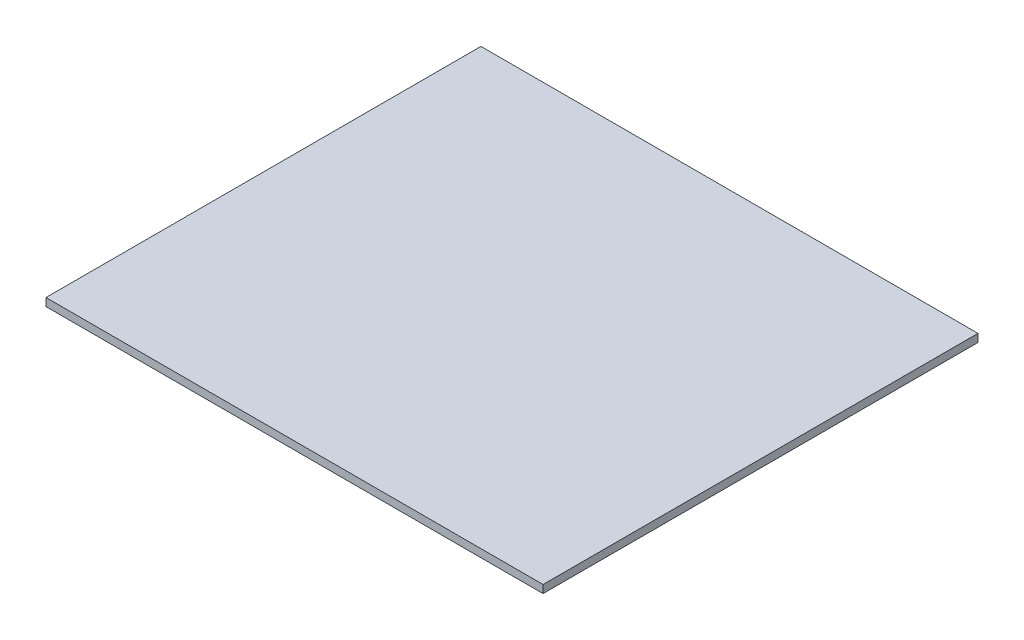
ISO-10303-21;
HEADER;
FILE_DESCRIPTION(('STEP AP214'),'2;1');
FILE_NAME('part.step','',(''),(''),'','','');
FILE_SCHEMA(('AUTOMOTIVE_DESIGN { 1 0 10303 214 1 1 1 1 }'));
ENDSEC;
DATA;
#1=APPLICATION_CONTEXT('core data for automotive mechanical design processes');
#2=APPLICATION_PROTOCOL_DEFINITION('international standard','automotive_design',2000,#1);
#3=PRODUCT_CONTEXT('',#1,'mechanical');
#4=PRODUCT('Part','Part','',(#3));
#5=PRODUCT_RELATED_PRODUCT_CATEGORY('part','',(#4));
#6=PRODUCT_DEFINITION_FORMATION('','',#4);
#7=PRODUCT_DEFINITION_CONTEXT('part definition',#1,'design');
#8=PRODUCT_DEFINITION('design','',#6,#7);
#9=PRODUCT_DEFINITION_SHAPE('','',#8);
#10=(LENGTH_UNIT() NAMED_UNIT(*) SI_UNIT(.MILLI.,.METRE.));
#11=(NAMED_UNIT(*) PLANE_ANGLE_UNIT() SI_UNIT($,.RADIAN.));
#12=(NAMED_UNIT(*) SI_UNIT($,.STERADIAN.) SOLID_ANGLE_UNIT());
#13=UNCERTAINTY_MEASURE_WITH_UNIT(LENGTH_MEASURE(1.E-05),#10,'distance_accuracy_value','');
#14=(GEOMETRIC_REPRESENTATION_CONTEXT(3) GLOBAL_UNCERTAINTY_ASSIGNED_CONTEXT((#13)) GLOBAL_UNIT_ASSIGNED_CONTEXT((#10,
#11,#12)) REPRESENTATION_CONTEXT('',''));
#15=CARTESIAN_POINT('',(0.,0.,0.));
#16=DIRECTION('',(0.,0.,1.));
#17=DIRECTION('',(1.,0.,0.));
#18=AXIS2_PLACEMENT_3D('',#15,#16,#17);
#19=CARTESIAN_POINT('',(0.,6.35,0.));
#20=DIRECTION('',(1.,0.,0.));
#21=DIRECTION('',(0.,0.,-1.));
#22=AXIS2_PLACEMENT_3D('',#19,#20,#21);
#23=PLANE('',#22);
#24=DIRECTION('',(0.,0.,1.));
#25=VECTOR('',#24,1.);
#26=CARTESIAN_POINT('',(0.,0.,0.));
#27=LINE('',#26,#25);
#28=CARTESIAN_POINT('',(0.,0.,-350.));
#29=VERTEX_POINT('',#28);
#30=CARTESIAN_POINT('',(0.,0.,0.));
#31=VERTEX_POINT('',#30);
#32=EDGE_CURVE('E108',#29,#31,#27,.T.);
#33=ORIENTED_EDGE('',*,*,#32,.T.);
#34=DIRECTION('',(0.,-1.,0.));
#35=VECTOR('',#34,1.);
#36=CARTESIAN_POINT('',(0.,6.35,0.));
#37=LINE('',#36,#35);
#38=CARTESIAN_POINT('',(0.,6.35,0.));
#39=VERTEX_POINT('',#38);
#40=EDGE_CURVE('E11',#39,#31,#37,.T.);
#41=ORIENTED_EDGE('',*,*,#40,.F.);
#42=DIRECTION('',(0.,0.,1.));
#43=VECTOR('',#42,1.);
#44=CARTESIAN_POINT('',(0.,6.35,0.));
#45=LINE('',#44,#43);
#46=CARTESIAN_POINT('',(0.,6.35,-350.));
#47=VERTEX_POINT('',#46);
#48=EDGE_CURVE('E96',#47,#39,#45,.T.);
#49=ORIENTED_EDGE('',*,*,#48,.F.);
#50=DIRECTION('',(0.,-1.,0.));
#51=VECTOR('',#50,1.);
#52=CARTESIAN_POINT('',(0.,6.35,-350.));
#53=LINE('',#52,#51);
#54=EDGE_CURVE('E104',#47,#29,#53,.T.);
#55=ORIENTED_EDGE('',*,*,#54,.T.);
#56=EDGE_LOOP('',(#33,#41,#49,#55));
#57=FACE_BOUND('',#56,.T.);
#58=ADVANCED_FACE('F45',(#57),#23,.F.);
#59=CARTESIAN_POINT('',(0.,6.35,0.));
#60=DIRECTION('',(0.,0.,-1.));
#61=DIRECTION('',(-1.,0.,0.));
#62=AXIS2_PLACEMENT_3D('',#59,#60,#61);
#63=PLANE('',#62);
#64=DIRECTION('',(1.,0.,0.));
#65=VECTOR('',#64,1.);
#66=CARTESIAN_POINT('',(0.,0.,0.));
#67=LINE('',#66,#65);
#68=CARTESIAN_POINT('',(400.,0.,0.));
#69=VERTEX_POINT('',#68);
#70=EDGE_CURVE('E100',#31,#69,#67,.T.);
#71=ORIENTED_EDGE('',*,*,#70,.T.);
#72=DIRECTION('',(0.,-1.,0.));
#73=VECTOR('',#72,1.);
#74=CARTESIAN_POINT('',(400.,6.35,0.));
#75=LINE('',#74,#73);
#76=CARTESIAN_POINT('',(400.,6.35,0.));
#77=VERTEX_POINT('',#76);
#78=EDGE_CURVE('E53',#77,#69,#75,.T.);
#79=ORIENTED_EDGE('',*,*,#78,.F.);
#80=DIRECTION('',(1.,0.,0.));
#81=VECTOR('',#80,1.);
#82=CARTESIAN_POINT('',(0.,6.35,0.));
#83=LINE('',#82,#81);
#84=EDGE_CURVE('E91',#39,#77,#83,.T.);
#85=ORIENTED_EDGE('',*,*,#84,.F.);
#86=ORIENTED_EDGE('',*,*,#40,.T.);
#87=EDGE_LOOP('',(#71,#79,#85,#86));
#88=FACE_BOUND('',#87,.T.);
#89=ADVANCED_FACE('F99',(#88),#63,.F.);
#90=CARTESIAN_POINT('',(400.,6.35,0.));
#91=DIRECTION('',(-1.,0.,0.));
#92=DIRECTION('',(0.,0.,1.));
#93=AXIS2_PLACEMENT_3D('',#90,#91,#92);
#94=PLANE('',#93);
#95=DIRECTION('',(0.,0.,-1.));
#96=VECTOR('',#95,1.);
#97=CARTESIAN_POINT('',(400.,0.,0.));
#98=LINE('',#97,#96);
#99=CARTESIAN_POINT('',(400.,0.,-350.));
#100=VERTEX_POINT('',#99);
#101=EDGE_CURVE('E78',#69,#100,#98,.T.);
#102=ORIENTED_EDGE('',*,*,#101,.T.);
#103=DIRECTION('',(0.,-1.,0.));
#104=VECTOR('',#103,1.);
#105=CARTESIAN_POINT('',(400.,6.35,-350.));
#106=LINE('',#105,#104);
#107=CARTESIAN_POINT('',(400.,6.35,-350.));
#108=VERTEX_POINT('',#107);
#109=EDGE_CURVE('E101',#108,#100,#106,.T.);
#110=ORIENTED_EDGE('',*,*,#109,.F.);
#111=DIRECTION('',(0.,0.,-1.));
#112=VECTOR('',#111,1.);
#113=CARTESIAN_POINT('',(400.,6.35,0.));
#114=LINE('',#113,#112);
#115=EDGE_CURVE('E94',#77,#108,#114,.T.);
#116=ORIENTED_EDGE('',*,*,#115,.F.);
#117=ORIENTED_EDGE('',*,*,#78,.T.);
#118=EDGE_LOOP('',(#102,#110,#116,#117));
#119=FACE_BOUND('',#118,.T.);
#120=ADVANCED_FACE('F102',(#119),#94,.F.);
#121=CARTESIAN_POINT('',(0.,6.35,-350.));
#122=DIRECTION('',(0.,0.,1.));
#123=DIRECTION('',(1.,0.,0.));
#124=AXIS2_PLACEMENT_3D('',#121,#122,#123);
#125=PLANE('',#124);
#126=DIRECTION('',(-1.,0.,0.));
#127=VECTOR('',#126,1.);
#128=CARTESIAN_POINT('',(0.,0.,-350.));
#129=LINE('',#128,#127);
#130=EDGE_CURVE('E84',#100,#29,#129,.T.);
#131=ORIENTED_EDGE('',*,*,#130,.T.);
#132=ORIENTED_EDGE('',*,*,#54,.F.);
#133=DIRECTION('',(-1.,0.,0.));
#134=VECTOR('',#133,1.);
#135=CARTESIAN_POINT('',(0.,6.35,-350.));
#136=LINE('',#135,#134);
#137=EDGE_CURVE('E61',#108,#47,#136,.T.);
#138=ORIENTED_EDGE('',*,*,#137,.F.);
#139=ORIENTED_EDGE('',*,*,#109,.T.);
#140=EDGE_LOOP('',(#131,#132,#138,#139));
#141=FACE_BOUND('',#140,.T.);
#142=ADVANCED_FACE('F115',(#141),#125,.F.);
#143=CARTESIAN_POINT('',(0.,6.35,0.));
#144=DIRECTION('',(0.,-1.,0.));
#145=DIRECTION('',(0.,0.,-1.));
#146=AXIS2_PLACEMENT_3D('',#143,#144,#145);
#147=PLANE('',#146);
#148=ORIENTED_EDGE('',*,*,#48,.T.);
#149=ORIENTED_EDGE('',*,*,#84,.T.);
#150=ORIENTED_EDGE('',*,*,#115,.T.);
#151=ORIENTED_EDGE('',*,*,#137,.T.);
#152=EDGE_LOOP('',(#148,#149,#150,#151));
#153=FACE_BOUND('',#152,.T.);
#154=ADVANCED_FACE('F92',(#153),#147,.F.);
#155=CARTESIAN_POINT('',(0.,0.,0.));
#156=DIRECTION('',(0.,-1.,0.));
#157=DIRECTION('',(0.,0.,-1.));
#158=AXIS2_PLACEMENT_3D('',#155,#156,#157);
#159=PLANE('',#158);
#160=ORIENTED_EDGE('',*,*,#32,.F.);
#161=ORIENTED_EDGE('',*,*,#130,.F.);
#162=ORIENTED_EDGE('',*,*,#101,.F.);
#163=ORIENTED_EDGE('',*,*,#70,.F.);
#164=EDGE_LOOP('',(#160,#161,#162,#163));
#165=FACE_BOUND('',#164,.T.);
#166=ADVANCED_FACE('F118',(#165),#159,.T.);
#167=CLOSED_SHELL('',(#58,#89,#120,#142,#154,#166));
#168=MANIFOLD_SOLID_BREP('B2',#167);
#169=ADVANCED_BREP_SHAPE_REPRESENTATION('',(#18,#168),#14);
#170=SHAPE_DEFINITION_REPRESENTATION(#9,#169);
ENDSEC;
END-ISO-10303-21;
